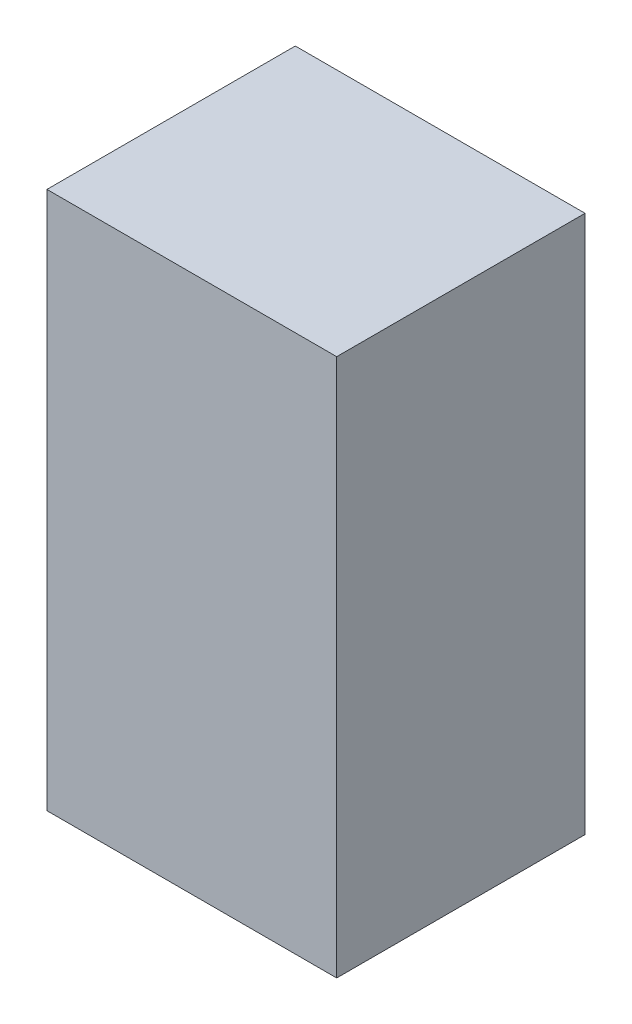
ISO-10303-21;
HEADER;
FILE_DESCRIPTION(('STEP AP214'),'2;1');
FILE_NAME('part.step','',(''),(''),'','','');
FILE_SCHEMA(('AUTOMOTIVE_DESIGN { 1 0 10303 214 1 1 1 1 }'));
ENDSEC;
DATA;
#1=APPLICATION_CONTEXT('core data for automotive mechanical design processes');
#2=APPLICATION_PROTOCOL_DEFINITION('international standard','automotive_design',2000,#1);
#3=PRODUCT_CONTEXT('',#1,'mechanical');
#4=PRODUCT('Part','Part','',(#3));
#5=PRODUCT_RELATED_PRODUCT_CATEGORY('part','',(#4));
#6=PRODUCT_DEFINITION_FORMATION('','',#4);
#7=PRODUCT_DEFINITION_CONTEXT('part definition',#1,'design');
#8=PRODUCT_DEFINITION('design','',#6,#7);
#9=PRODUCT_DEFINITION_SHAPE('','',#8);
#10=(LENGTH_UNIT() NAMED_UNIT(*) SI_UNIT(.MILLI.,.METRE.));
#11=(NAMED_UNIT(*) PLANE_ANGLE_UNIT() SI_UNIT($,.RADIAN.));
#12=(NAMED_UNIT(*) SI_UNIT($,.STERADIAN.) SOLID_ANGLE_UNIT());
#13=UNCERTAINTY_MEASURE_WITH_UNIT(LENGTH_MEASURE(1.E-05),#10,'distance_accuracy_value','');
#14=(GEOMETRIC_REPRESENTATION_CONTEXT(3) GLOBAL_UNCERTAINTY_ASSIGNED_CONTEXT((#13)) GLOBAL_UNIT_ASSIGNED_CONTEXT((#10,
#11,#12)) REPRESENTATION_CONTEXT('',''));
#15=CARTESIAN_POINT('',(0.,0.,0.));
#16=DIRECTION('',(0.,0.,1.));
#17=DIRECTION('',(1.,0.,0.));
#18=AXIS2_PLACEMENT_3D('',#15,#16,#17);
#19=CARTESIAN_POINT('',(-427.808695606175,379.895652173914,60.));
#20=DIRECTION('',(1.,0.,0.));
#21=DIRECTION('',(0.,0.,-1.));
#22=AXIS2_PLACEMENT_3D('',#19,#20,#21);
#23=PLANE('',#22);
#24=DIRECTION('',(0.,-1.,0.));
#25=VECTOR('',#24,1.);
#26=CARTESIAN_POINT('',(-427.808695606175,379.895652173914,0.));
#27=LINE('',#26,#25);
#28=CARTESIAN_POINT('',(-427.808695606175,379.895652173914,0.));
#29=VERTEX_POINT('',#28);
#30=CARTESIAN_POINT('',(-427.808695606175,249.895652077914,0.));
#31=VERTEX_POINT('',#30);
#32=EDGE_CURVE('E96',#29,#31,#27,.T.);
#33=ORIENTED_EDGE('',*,*,#32,.T.);
#34=DIRECTION('',(0.,0.,-1.));
#35=VECTOR('',#34,1.);
#36=CARTESIAN_POINT('',(-427.808695606175,249.895652077914,60.));
#37=LINE('',#36,#35);
#38=CARTESIAN_POINT('',(-427.808695606175,249.895652077914,60.));
#39=VERTEX_POINT('',#38);
#40=EDGE_CURVE('E11',#39,#31,#37,.T.);
#41=ORIENTED_EDGE('',*,*,#40,.F.);
#42=DIRECTION('',(0.,-1.,0.));
#43=VECTOR('',#42,1.);
#44=CARTESIAN_POINT('',(-427.808695606175,379.895652173914,60.));
#45=LINE('',#44,#43);
#46=CARTESIAN_POINT('',(-427.808695606175,379.895652173914,60.));
#47=VERTEX_POINT('',#46);
#48=EDGE_CURVE('E84',#47,#39,#45,.T.);
#49=ORIENTED_EDGE('',*,*,#48,.F.);
#50=DIRECTION('',(0.,0.,-1.));
#51=VECTOR('',#50,1.);
#52=CARTESIAN_POINT('',(-427.808695606175,379.895652173914,60.));
#53=LINE('',#52,#51);
#54=EDGE_CURVE('E92',#47,#29,#53,.T.);
#55=ORIENTED_EDGE('',*,*,#54,.T.);
#56=EDGE_LOOP('',(#33,#41,#49,#55));
#57=FACE_BOUND('',#56,.T.);
#58=ADVANCED_FACE('F33',(#57),#23,.F.);
#59=CARTESIAN_POINT('',(-427.808695606175,249.895652077914,60.));
#60=DIRECTION('',(0.,1.,0.));
#61=DIRECTION('',(0.,0.,1.));
#62=AXIS2_PLACEMENT_3D('',#59,#60,#61);
#63=PLANE('',#62);
#64=DIRECTION('',(1.,0.,0.));
#65=VECTOR('',#64,1.);
#66=CARTESIAN_POINT('',(-427.808695606175,249.895652077914,0.));
#67=LINE('',#66,#65);
#68=CARTESIAN_POINT('',(-357.808695652175,249.895652077914,0.));
#69=VERTEX_POINT('',#68);
#70=EDGE_CURVE('E88',#31,#69,#67,.T.);
#71=ORIENTED_EDGE('',*,*,#70,.T.);
#72=DIRECTION('',(0.,0.,-1.));
#73=VECTOR('',#72,1.);
#74=CARTESIAN_POINT('',(-357.808695652175,249.895652077914,60.));
#75=LINE('',#74,#73);
#76=CARTESIAN_POINT('',(-357.808695652175,249.895652077914,60.));
#77=VERTEX_POINT('',#76);
#78=EDGE_CURVE('E41',#77,#69,#75,.T.);
#79=ORIENTED_EDGE('',*,*,#78,.F.);
#80=DIRECTION('',(1.,0.,0.));
#81=VECTOR('',#80,1.);
#82=CARTESIAN_POINT('',(-427.808695606175,249.895652077914,60.));
#83=LINE('',#82,#81);
#84=EDGE_CURVE('E79',#39,#77,#83,.T.);
#85=ORIENTED_EDGE('',*,*,#84,.F.);
#86=ORIENTED_EDGE('',*,*,#40,.T.);
#87=EDGE_LOOP('',(#71,#79,#85,#86));
#88=FACE_BOUND('',#87,.T.);
#89=ADVANCED_FACE('F87',(#88),#63,.F.);
#90=CARTESIAN_POINT('',(-357.808695652175,379.895652173914,60.));
#91=DIRECTION('',(-1.,0.,0.));
#92=DIRECTION('',(0.,0.,1.));
#93=AXIS2_PLACEMENT_3D('',#90,#91,#92);
#94=PLANE('',#93);
#95=DIRECTION('',(0.,1.,0.));
#96=VECTOR('',#95,1.);
#97=CARTESIAN_POINT('',(-357.808695652175,379.895652173914,0.));
#98=LINE('',#97,#96);
#99=CARTESIAN_POINT('',(-357.808695652175,379.895652173914,0.));
#100=VERTEX_POINT('',#99);
#101=EDGE_CURVE('E66',#69,#100,#98,.T.);
#102=ORIENTED_EDGE('',*,*,#101,.T.);
#103=DIRECTION('',(0.,0.,-1.));
#104=VECTOR('',#103,1.);
#105=CARTESIAN_POINT('',(-357.808695652175,379.895652173914,60.));
#106=LINE('',#105,#104);
#107=CARTESIAN_POINT('',(-357.808695652175,379.895652173914,60.));
#108=VERTEX_POINT('',#107);
#109=EDGE_CURVE('E89',#108,#100,#106,.T.);
#110=ORIENTED_EDGE('',*,*,#109,.F.);
#111=DIRECTION('',(0.,1.,0.));
#112=VECTOR('',#111,1.);
#113=CARTESIAN_POINT('',(-357.808695652175,379.895652173914,60.));
#114=LINE('',#113,#112);
#115=EDGE_CURVE('E82',#77,#108,#114,.T.);
#116=ORIENTED_EDGE('',*,*,#115,.F.);
#117=ORIENTED_EDGE('',*,*,#78,.T.);
#118=EDGE_LOOP('',(#102,#110,#116,#117));
#119=FACE_BOUND('',#118,.T.);
#120=ADVANCED_FACE('F90',(#119),#94,.F.);
#121=CARTESIAN_POINT('',(-427.808695606175,379.895652173914,60.));
#122=DIRECTION('',(0.,-1.,0.));
#123=DIRECTION('',(0.,0.,-1.));
#124=AXIS2_PLACEMENT_3D('',#121,#122,#123);
#125=PLANE('',#124);
#126=DIRECTION('',(-1.,0.,0.));
#127=VECTOR('',#126,1.);
#128=CARTESIAN_POINT('',(-427.808695606175,379.895652173914,0.));
#129=LINE('',#128,#127);
#130=EDGE_CURVE('E72',#100,#29,#129,.T.);
#131=ORIENTED_EDGE('',*,*,#130,.T.);
#132=ORIENTED_EDGE('',*,*,#54,.F.);
#133=DIRECTION('',(-1.,0.,0.));
#134=VECTOR('',#133,1.);
#135=CARTESIAN_POINT('',(-427.808695606175,379.895652173914,60.));
#136=LINE('',#135,#134);
#137=EDGE_CURVE('E49',#108,#47,#136,.T.);
#138=ORIENTED_EDGE('',*,*,#137,.F.);
#139=ORIENTED_EDGE('',*,*,#109,.T.);
#140=EDGE_LOOP('',(#131,#132,#138,#139));
#141=FACE_BOUND('',#140,.T.);
#142=ADVANCED_FACE('F103',(#141),#125,.F.);
#143=CARTESIAN_POINT('',(0.,0.,60.));
#144=DIRECTION('',(0.,0.,1.));
#145=DIRECTION('',(1.,0.,0.));
#146=AXIS2_PLACEMENT_3D('',#143,#144,#145);
#147=PLANE('',#146);
#148=ORIENTED_EDGE('',*,*,#48,.T.);
#149=ORIENTED_EDGE('',*,*,#84,.T.);
#150=ORIENTED_EDGE('',*,*,#115,.T.);
#151=ORIENTED_EDGE('',*,*,#137,.T.);
#152=EDGE_LOOP('',(#148,#149,#150,#151));
#153=FACE_BOUND('',#152,.T.);
#154=ADVANCED_FACE('F80',(#153),#147,.T.);
#155=CARTESIAN_POINT('',(0.,0.,0.));
#156=DIRECTION('',(0.,0.,1.));
#157=DIRECTION('',(1.,0.,0.));
#158=AXIS2_PLACEMENT_3D('',#155,#156,#157);
#159=PLANE('',#158);
#160=ORIENTED_EDGE('',*,*,#32,.F.);
#161=ORIENTED_EDGE('',*,*,#130,.F.);
#162=ORIENTED_EDGE('',*,*,#101,.F.);
#163=ORIENTED_EDGE('',*,*,#70,.F.);
#164=EDGE_LOOP('',(#160,#161,#162,#163));
#165=FACE_BOUND('',#164,.T.);
#166=ADVANCED_FACE('F106',(#165),#159,.F.);
#167=CLOSED_SHELL('',(#58,#89,#120,#142,#154,#166));
#168=MANIFOLD_SOLID_BREP('B2',#167);
#169=ADVANCED_BREP_SHAPE_REPRESENTATION('',(#18,#168),#14);
#170=SHAPE_DEFINITION_REPRESENTATION(#9,#169);
ENDSEC;
END-ISO-10303-21;
